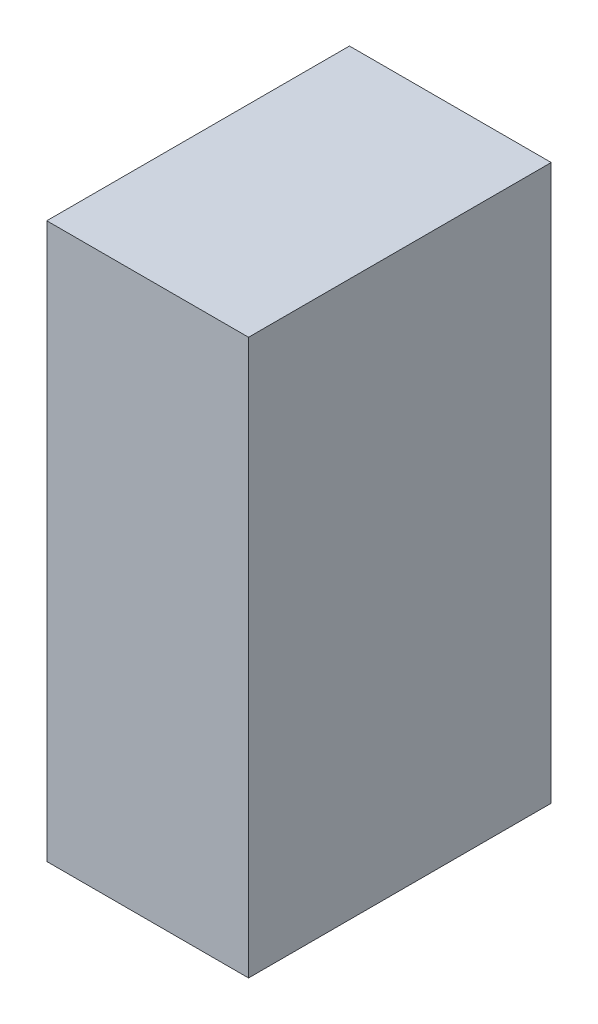
ISO-10303-21;
HEADER;
FILE_DESCRIPTION(('STEP AP214'),'2;1');
FILE_NAME('part.step','',(''),(''),'','','');
FILE_SCHEMA(('AUTOMOTIVE_DESIGN { 1 0 10303 214 1 1 1 1 }'));
ENDSEC;
DATA;
#1=APPLICATION_CONTEXT('core data for automotive mechanical design processes');
#2=APPLICATION_PROTOCOL_DEFINITION('international standard','automotive_design',2000,#1);
#3=PRODUCT_CONTEXT('',#1,'mechanical');
#4=PRODUCT('Part','Part','',(#3));
#5=PRODUCT_RELATED_PRODUCT_CATEGORY('part','',(#4));
#6=PRODUCT_DEFINITION_FORMATION('','',#4);
#7=PRODUCT_DEFINITION_CONTEXT('part definition',#1,'design');
#8=PRODUCT_DEFINITION('design','',#6,#7);
#9=PRODUCT_DEFINITION_SHAPE('','',#8);
#10=(LENGTH_UNIT() NAMED_UNIT(*) SI_UNIT(.MILLI.,.METRE.));
#11=(NAMED_UNIT(*) PLANE_ANGLE_UNIT() SI_UNIT($,.RADIAN.));
#12=(NAMED_UNIT(*) SI_UNIT($,.STERADIAN.) SOLID_ANGLE_UNIT());
#13=UNCERTAINTY_MEASURE_WITH_UNIT(LENGTH_MEASURE(1.E-05),#10,'distance_accuracy_value','');
#14=(GEOMETRIC_REPRESENTATION_CONTEXT(3) GLOBAL_UNCERTAINTY_ASSIGNED_CONTEXT((#13)) GLOBAL_UNIT_ASSIGNED_CONTEXT((#10,
#11,#12)) REPRESENTATION_CONTEXT('',''));
#15=CARTESIAN_POINT('',(0.,0.,0.));
#16=DIRECTION('',(0.,0.,1.));
#17=DIRECTION('',(1.,0.,0.));
#18=AXIS2_PLACEMENT_3D('',#15,#16,#17);
#19=CARTESIAN_POINT('',(20.,110.,30.));
#20=DIRECTION('',(-1.,0.,0.));
#21=DIRECTION('',(0.,0.,1.));
#22=AXIS2_PLACEMENT_3D('',#19,#20,#21);
#23=PLANE('',#22);
#24=DIRECTION('',(0.,0.,-1.));
#25=VECTOR('',#24,1.);
#26=CARTESIAN_POINT('',(20.,0.,30.));
#27=LINE('',#26,#25);
#28=CARTESIAN_POINT('',(20.,0.,30.));
#29=VERTEX_POINT('',#28);
#30=CARTESIAN_POINT('',(20.,0.,-30.));
#31=VERTEX_POINT('',#30);
#32=EDGE_CURVE('E97',#29,#31,#27,.T.);
#33=ORIENTED_EDGE('',*,*,#32,.T.);
#34=DIRECTION('',(0.,-1.,0.));
#35=VECTOR('',#34,1.);
#36=CARTESIAN_POINT('',(20.,110.,-30.));
#37=LINE('',#36,#35);
#38=CARTESIAN_POINT('',(20.,110.,-30.));
#39=VERTEX_POINT('',#38);
#40=EDGE_CURVE('E11',#39,#31,#37,.T.);
#41=ORIENTED_EDGE('',*,*,#40,.F.);
#42=DIRECTION('',(0.,0.,-1.));
#43=VECTOR('',#42,1.);
#44=CARTESIAN_POINT('',(20.,110.,30.));
#45=LINE('',#44,#43);
#46=CARTESIAN_POINT('',(20.,110.,30.));
#47=VERTEX_POINT('',#46);
#48=EDGE_CURVE('E85',#47,#39,#45,.T.);
#49=ORIENTED_EDGE('',*,*,#48,.F.);
#50=DIRECTION('',(0.,-1.,0.));
#51=VECTOR('',#50,1.);
#52=CARTESIAN_POINT('',(20.,110.,30.));
#53=LINE('',#52,#51);
#54=EDGE_CURVE('E93',#47,#29,#53,.T.);
#55=ORIENTED_EDGE('',*,*,#54,.T.);
#56=EDGE_LOOP('',(#33,#41,#49,#55));
#57=FACE_BOUND('',#56,.T.);
#58=ADVANCED_FACE('F34',(#57),#23,.F.);
#59=CARTESIAN_POINT('',(-20.,110.,-30.));
#60=DIRECTION('',(0.,0.,1.));
#61=DIRECTION('',(1.,0.,0.));
#62=AXIS2_PLACEMENT_3D('',#59,#60,#61);
#63=PLANE('',#62);
#64=DIRECTION('',(-1.,0.,0.));
#65=VECTOR('',#64,1.);
#66=CARTESIAN_POINT('',(-20.,0.,-30.));
#67=LINE('',#66,#65);
#68=CARTESIAN_POINT('',(-20.,0.,-30.));
#69=VERTEX_POINT('',#68);
#70=EDGE_CURVE('E89',#31,#69,#67,.T.);
#71=ORIENTED_EDGE('',*,*,#70,.T.);
#72=DIRECTION('',(0.,-1.,0.));
#73=VECTOR('',#72,1.);
#74=CARTESIAN_POINT('',(-20.,110.,-30.));
#75=LINE('',#74,#73);
#76=CARTESIAN_POINT('',(-20.,110.,-30.));
#77=VERTEX_POINT('',#76);
#78=EDGE_CURVE('E42',#77,#69,#75,.T.);
#79=ORIENTED_EDGE('',*,*,#78,.F.);
#80=DIRECTION('',(-1.,0.,0.));
#81=VECTOR('',#80,1.);
#82=CARTESIAN_POINT('',(-20.,110.,-30.));
#83=LINE('',#82,#81);
#84=EDGE_CURVE('E80',#39,#77,#83,.T.);
#85=ORIENTED_EDGE('',*,*,#84,.F.);
#86=ORIENTED_EDGE('',*,*,#40,.T.);
#87=EDGE_LOOP('',(#71,#79,#85,#86));
#88=FACE_BOUND('',#87,.T.);
#89=ADVANCED_FACE('F88',(#88),#63,.F.);
#90=CARTESIAN_POINT('',(-20.,110.,30.));
#91=DIRECTION('',(1.,0.,0.));
#92=DIRECTION('',(0.,0.,-1.));
#93=AXIS2_PLACEMENT_3D('',#90,#91,#92);
#94=PLANE('',#93);
#95=DIRECTION('',(0.,0.,1.));
#96=VECTOR('',#95,1.);
#97=CARTESIAN_POINT('',(-20.,0.,30.));
#98=LINE('',#97,#96);
#99=CARTESIAN_POINT('',(-20.,0.,30.));
#100=VERTEX_POINT('',#99);
#101=EDGE_CURVE('E67',#69,#100,#98,.T.);
#102=ORIENTED_EDGE('',*,*,#101,.T.);
#103=DIRECTION('',(0.,-1.,0.));
#104=VECTOR('',#103,1.);
#105=CARTESIAN_POINT('',(-20.,110.,30.));
#106=LINE('',#105,#104);
#107=CARTESIAN_POINT('',(-20.,110.,30.));
#108=VERTEX_POINT('',#107);
#109=EDGE_CURVE('E90',#108,#100,#106,.T.);
#110=ORIENTED_EDGE('',*,*,#109,.F.);
#111=DIRECTION('',(0.,0.,1.));
#112=VECTOR('',#111,1.);
#113=CARTESIAN_POINT('',(-20.,110.,30.));
#114=LINE('',#113,#112);
#115=EDGE_CURVE('E83',#77,#108,#114,.T.);
#116=ORIENTED_EDGE('',*,*,#115,.F.);
#117=ORIENTED_EDGE('',*,*,#78,.T.);
#118=EDGE_LOOP('',(#102,#110,#116,#117));
#119=FACE_BOUND('',#118,.T.);
#120=ADVANCED_FACE('F91',(#119),#94,.F.);
#121=CARTESIAN_POINT('',(-20.,110.,30.));
#122=DIRECTION('',(0.,0.,-1.));
#123=DIRECTION('',(-1.,0.,0.));
#124=AXIS2_PLACEMENT_3D('',#121,#122,#123);
#125=PLANE('',#124);
#126=DIRECTION('',(1.,0.,0.));
#127=VECTOR('',#126,1.);
#128=CARTESIAN_POINT('',(-20.,0.,30.));
#129=LINE('',#128,#127);
#130=EDGE_CURVE('E73',#100,#29,#129,.T.);
#131=ORIENTED_EDGE('',*,*,#130,.T.);
#132=ORIENTED_EDGE('',*,*,#54,.F.);
#133=DIRECTION('',(1.,0.,0.));
#134=VECTOR('',#133,1.);
#135=CARTESIAN_POINT('',(-20.,110.,30.));
#136=LINE('',#135,#134);
#137=EDGE_CURVE('E50',#108,#47,#136,.T.);
#138=ORIENTED_EDGE('',*,*,#137,.F.);
#139=ORIENTED_EDGE('',*,*,#109,.T.);
#140=EDGE_LOOP('',(#131,#132,#138,#139));
#141=FACE_BOUND('',#140,.T.);
#142=ADVANCED_FACE('F104',(#141),#125,.F.);
#143=CARTESIAN_POINT('',(0.,110.,0.));
#144=DIRECTION('',(0.,-1.,0.));
#145=DIRECTION('',(0.,0.,-1.));
#146=AXIS2_PLACEMENT_3D('',#143,#144,#145);
#147=PLANE('',#146);
#148=ORIENTED_EDGE('',*,*,#48,.T.);
#149=ORIENTED_EDGE('',*,*,#84,.T.);
#150=ORIENTED_EDGE('',*,*,#115,.T.);
#151=ORIENTED_EDGE('',*,*,#137,.T.);
#152=EDGE_LOOP('',(#148,#149,#150,#151));
#153=FACE_BOUND('',#152,.T.);
#154=ADVANCED_FACE('F81',(#153),#147,.F.);
#155=CARTESIAN_POINT('',(0.,0.,0.));
#156=DIRECTION('',(0.,-1.,0.));
#157=DIRECTION('',(0.,0.,-1.));
#158=AXIS2_PLACEMENT_3D('',#155,#156,#157);
#159=PLANE('',#158);
#160=ORIENTED_EDGE('',*,*,#32,.F.);
#161=ORIENTED_EDGE('',*,*,#130,.F.);
#162=ORIENTED_EDGE('',*,*,#101,.F.);
#163=ORIENTED_EDGE('',*,*,#70,.F.);
#164=EDGE_LOOP('',(#160,#161,#162,#163));
#165=FACE_BOUND('',#164,.T.);
#166=ADVANCED_FACE('F107',(#165),#159,.T.);
#167=CLOSED_SHELL('',(#58,#89,#120,#142,#154,#166));
#168=MANIFOLD_SOLID_BREP('B2',#167);
#169=ADVANCED_BREP_SHAPE_REPRESENTATION('',(#18,#168),#14);
#170=SHAPE_DEFINITION_REPRESENTATION(#9,#169);
ENDSEC;
END-ISO-10303-21;
